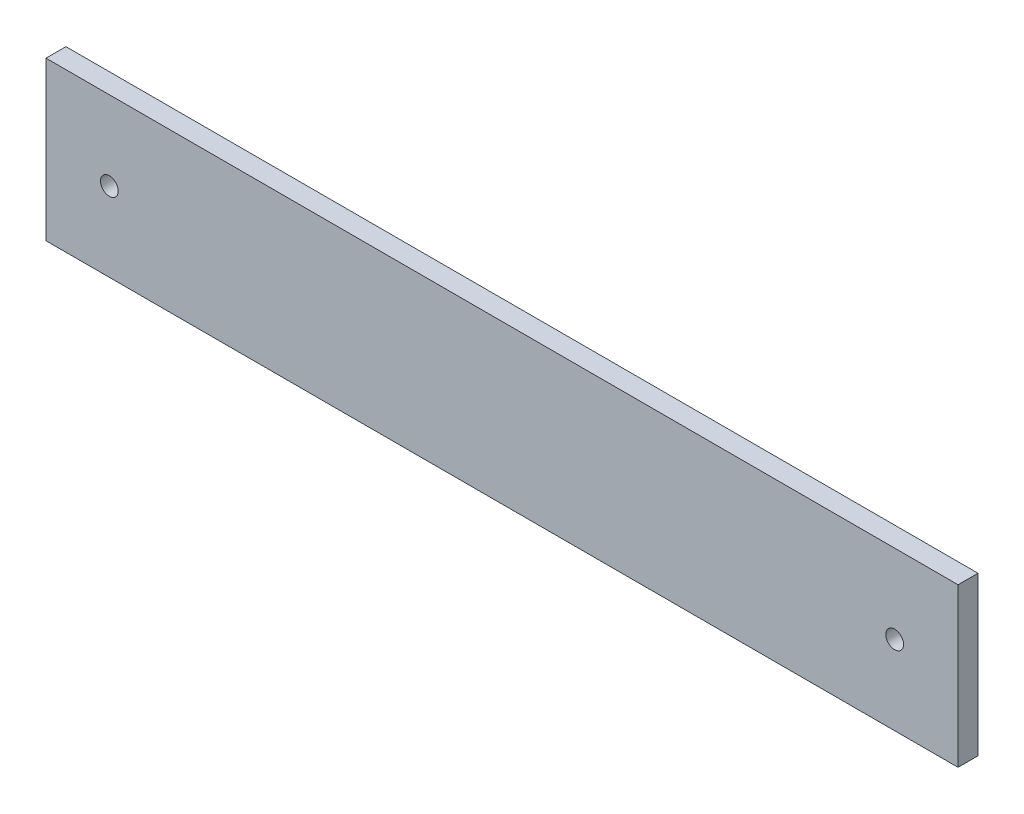
ISO-10303-21;
HEADER;
FILE_DESCRIPTION(('STEP AP214'),'2;1');
FILE_NAME('part.step','',(''),(''),'','','');
FILE_SCHEMA(('AUTOMOTIVE_DESIGN { 1 0 10303 214 1 1 1 1 }'));
ENDSEC;
DATA;
#1=APPLICATION_CONTEXT('core data for automotive mechanical design processes');
#2=APPLICATION_PROTOCOL_DEFINITION('international standard','automotive_design',2000,#1);
#3=PRODUCT_CONTEXT('',#1,'mechanical');
#4=PRODUCT('Part','Part','',(#3));
#5=PRODUCT_RELATED_PRODUCT_CATEGORY('part','',(#4));
#6=PRODUCT_DEFINITION_FORMATION('','',#4);
#7=PRODUCT_DEFINITION_CONTEXT('part definition',#1,'design');
#8=PRODUCT_DEFINITION('design','',#6,#7);
#9=PRODUCT_DEFINITION_SHAPE('','',#8);
#10=(LENGTH_UNIT() NAMED_UNIT(*) SI_UNIT(.MILLI.,.METRE.));
#11=(NAMED_UNIT(*) PLANE_ANGLE_UNIT() SI_UNIT($,.RADIAN.));
#12=(NAMED_UNIT(*) SI_UNIT($,.STERADIAN.) SOLID_ANGLE_UNIT());
#13=UNCERTAINTY_MEASURE_WITH_UNIT(LENGTH_MEASURE(1.E-05),#10,'distance_accuracy_value','');
#14=(GEOMETRIC_REPRESENTATION_CONTEXT(3) GLOBAL_UNCERTAINTY_ASSIGNED_CONTEXT((#13)) GLOBAL_UNIT_ASSIGNED_CONTEXT((#10,
#11,#12)) REPRESENTATION_CONTEXT('',''));
#15=CARTESIAN_POINT('',(0.,0.,0.));
#16=DIRECTION('',(0.,0.,1.));
#17=DIRECTION('',(1.,0.,0.));
#18=AXIS2_PLACEMENT_3D('',#15,#16,#17);
#19=CARTESIAN_POINT('',(0.,0.,3.175));
#20=DIRECTION('',(0.,0.,1.));
#21=DIRECTION('',(1.,0.,0.));
#22=AXIS2_PLACEMENT_3D('',#19,#20,#21);
#23=PLANE('',#22);
#24=CARTESIAN_POINT('',(-72.9352808051428,12.5,3.175));
#25=DIRECTION('',(0.,0.,1.));
#26=DIRECTION('',(1.,0.,0.));
#27=AXIS2_PLACEMENT_3D('',#24,#25,#26);
#28=CIRCLE('',#27,1.415);
#29=CARTESIAN_POINT('',(-71.5202808051427,12.5,3.175));
#30=VERTEX_POINT('',#29);
#31=EDGE_CURVE('E101',#30,#30,#28,.T.);
#32=ORIENTED_EDGE('',*,*,#31,.F.);
#33=EDGE_LOOP('',(#32));
#34=FACE_BOUND('',#33,.T.);
#35=DIRECTION('',(0.,-1.,0.));
#36=VECTOR('',#35,1.);
#37=CARTESIAN_POINT('',(-83.017378897971,25.0850222868298,3.175));
#38=LINE('',#37,#36);
#39=CARTESIAN_POINT('',(-83.017378897971,25.0850222868298,3.175));
#40=VERTEX_POINT('',#39);
#41=CARTESIAN_POINT('',(-83.017378897971,-0.0872443370543152,3.175));
#42=VERTEX_POINT('',#41);
#43=EDGE_CURVE('E86',#40,#42,#38,.T.);
#44=ORIENTED_EDGE('',*,*,#43,.T.);
#45=DIRECTION('',(1.,0.,0.));
#46=VECTOR('',#45,1.);
#47=CARTESIAN_POINT('',(-83.017378897971,-0.0872443370543152,3.175));
#48=LINE('',#47,#46);
#49=CARTESIAN_POINT('',(62.152621102029,-0.0872443370543152,3.175));
#50=VERTEX_POINT('',#49);
#51=EDGE_CURVE('E81',#42,#50,#48,.T.);
#52=ORIENTED_EDGE('',*,*,#51,.T.);
#53=DIRECTION('',(0.,1.,0.));
#54=VECTOR('',#53,1.);
#55=CARTESIAN_POINT('',(62.152621102029,25.0850222868298,3.175));
#56=LINE('',#55,#54);
#57=CARTESIAN_POINT('',(62.152621102029,25.0850222868298,3.175));
#58=VERTEX_POINT('',#57);
#59=EDGE_CURVE('E84',#50,#58,#56,.T.);
#60=ORIENTED_EDGE('',*,*,#59,.T.);
#61=DIRECTION('',(-1.,0.,0.));
#62=VECTOR('',#61,1.);
#63=CARTESIAN_POINT('',(-83.017378897971,25.0850222868298,3.175));
#64=LINE('',#63,#62);
#65=EDGE_CURVE('E51',#58,#40,#64,.T.);
#66=ORIENTED_EDGE('',*,*,#65,.T.);
#67=EDGE_LOOP('',(#44,#52,#60,#66));
#68=FACE_BOUND('',#67,.T.);
#69=CARTESIAN_POINT('',(52.0647191948572,12.5,3.175));
#70=DIRECTION('',(0.,0.,1.));
#71=DIRECTION('',(1.,0.,0.));
#72=AXIS2_PLACEMENT_3D('',#69,#70,#71);
#73=CIRCLE('',#72,1.415);
#74=CARTESIAN_POINT('',(53.4797191948572,12.5,3.175));
#75=VERTEX_POINT('',#74);
#76=EDGE_CURVE('E116',#75,#75,#73,.T.);
#77=ORIENTED_EDGE('',*,*,#76,.F.);
#78=EDGE_LOOP('',(#77));
#79=FACE_BOUND('',#78,.T.);
#80=ADVANCED_FACE('F34',(#34,#68,#79),#23,.T.);
#81=CARTESIAN_POINT('',(0.,0.,0.));
#82=DIRECTION('',(0.,0.,1.));
#83=DIRECTION('',(1.,0.,0.));
#84=AXIS2_PLACEMENT_3D('',#81,#82,#83);
#85=PLANE('',#84);
#86=DIRECTION('',(0.,-1.,0.));
#87=VECTOR('',#86,1.);
#88=CARTESIAN_POINT('',(-83.017378897971,25.0850222868298,0.));
#89=LINE('',#88,#87);
#90=CARTESIAN_POINT('',(-83.017378897971,25.0850222868298,0.));
#91=VERTEX_POINT('',#90);
#92=CARTESIAN_POINT('',(-83.017378897971,-0.0872443370543152,0.));
#93=VERTEX_POINT('',#92);
#94=EDGE_CURVE('E98',#91,#93,#89,.T.);
#95=ORIENTED_EDGE('',*,*,#94,.F.);
#96=DIRECTION('',(-1.,0.,0.));
#97=VECTOR('',#96,1.);
#98=CARTESIAN_POINT('',(-83.017378897971,25.0850222868298,0.));
#99=LINE('',#98,#97);
#100=CARTESIAN_POINT('',(62.152621102029,25.0850222868298,0.));
#101=VERTEX_POINT('',#100);
#102=EDGE_CURVE('E74',#101,#91,#99,.T.);
#103=ORIENTED_EDGE('',*,*,#102,.F.);
#104=DIRECTION('',(0.,1.,0.));
#105=VECTOR('',#104,1.);
#106=CARTESIAN_POINT('',(62.152621102029,25.0850222868298,0.));
#107=LINE('',#106,#105);
#108=CARTESIAN_POINT('',(62.152621102029,-0.0872443370543152,0.));
#109=VERTEX_POINT('',#108);
#110=EDGE_CURVE('E68',#109,#101,#107,.T.);
#111=ORIENTED_EDGE('',*,*,#110,.F.);
#112=DIRECTION('',(1.,0.,0.));
#113=VECTOR('',#112,1.);
#114=CARTESIAN_POINT('',(-83.017378897971,-0.0872443370543152,0.));
#115=LINE('',#114,#113);
#116=EDGE_CURVE('E90',#93,#109,#115,.T.);
#117=ORIENTED_EDGE('',*,*,#116,.F.);
#118=EDGE_LOOP('',(#95,#103,#111,#117));
#119=FACE_BOUND('',#118,.T.);
#120=CARTESIAN_POINT('',(-72.9352808051428,12.5,0.));
#121=DIRECTION('',(0.,0.,1.));
#122=DIRECTION('',(1.,0.,0.));
#123=AXIS2_PLACEMENT_3D('',#120,#121,#122);
#124=CIRCLE('',#123,1.415);
#125=CARTESIAN_POINT('',(-71.5202808051427,12.5,0.));
#126=VERTEX_POINT('',#125);
#127=EDGE_CURVE('E113',#126,#126,#124,.T.);
#128=ORIENTED_EDGE('',*,*,#127,.T.);
#129=EDGE_LOOP('',(#128));
#130=FACE_BOUND('',#129,.T.);
#131=CARTESIAN_POINT('',(52.0647191948572,12.5,0.));
#132=DIRECTION('',(0.,0.,1.));
#133=DIRECTION('',(1.,0.,0.));
#134=AXIS2_PLACEMENT_3D('',#131,#132,#133);
#135=CIRCLE('',#134,1.415);
#136=CARTESIAN_POINT('',(53.4797191948572,12.5,0.));
#137=VERTEX_POINT('',#136);
#138=EDGE_CURVE('E119',#137,#137,#135,.T.);
#139=ORIENTED_EDGE('',*,*,#138,.T.);
#140=EDGE_LOOP('',(#139));
#141=FACE_BOUND('',#140,.T.);
#142=ADVANCED_FACE('F109',(#119,#130,#141),#85,.F.);
#143=CARTESIAN_POINT('',(-83.017378897971,25.0850222868298,3.175));
#144=DIRECTION('',(1.,0.,0.));
#145=DIRECTION('',(0.,0.,-1.));
#146=AXIS2_PLACEMENT_3D('',#143,#144,#145);
#147=PLANE('',#146);
#148=ORIENTED_EDGE('',*,*,#94,.T.);
#149=DIRECTION('',(0.,0.,-1.));
#150=VECTOR('',#149,1.);
#151=CARTESIAN_POINT('',(-83.017378897971,-0.0872443370543152,3.175));
#152=LINE('',#151,#150);
#153=EDGE_CURVE('E11',#42,#93,#152,.T.);
#154=ORIENTED_EDGE('',*,*,#153,.F.);
#155=ORIENTED_EDGE('',*,*,#43,.F.);
#156=DIRECTION('',(0.,0.,-1.));
#157=VECTOR('',#156,1.);
#158=CARTESIAN_POINT('',(-83.017378897971,25.0850222868298,3.175));
#159=LINE('',#158,#157);
#160=EDGE_CURVE('E94',#40,#91,#159,.T.);
#161=ORIENTED_EDGE('',*,*,#160,.T.);
#162=EDGE_LOOP('',(#148,#154,#155,#161));
#163=FACE_BOUND('',#162,.T.);
#164=ADVANCED_FACE('F36',(#163),#147,.F.);
#165=CARTESIAN_POINT('',(-83.017378897971,-0.0872443370543152,3.175));
#166=DIRECTION('',(0.,1.,0.));
#167=DIRECTION('',(0.,0.,1.));
#168=AXIS2_PLACEMENT_3D('',#165,#166,#167);
#169=PLANE('',#168);
#170=ORIENTED_EDGE('',*,*,#116,.T.);
#171=DIRECTION('',(0.,0.,-1.));
#172=VECTOR('',#171,1.);
#173=CARTESIAN_POINT('',(62.152621102029,-0.0872443370543152,3.175));
#174=LINE('',#173,#172);
#175=EDGE_CURVE('E43',#50,#109,#174,.T.);
#176=ORIENTED_EDGE('',*,*,#175,.F.);
#177=ORIENTED_EDGE('',*,*,#51,.F.);
#178=ORIENTED_EDGE('',*,*,#153,.T.);
#179=EDGE_LOOP('',(#170,#176,#177,#178));
#180=FACE_BOUND('',#179,.T.);
#181=ADVANCED_FACE('F89',(#180),#169,.F.);
#182=CARTESIAN_POINT('',(62.152621102029,25.0850222868298,3.175));
#183=DIRECTION('',(-1.,0.,0.));
#184=DIRECTION('',(0.,0.,1.));
#185=AXIS2_PLACEMENT_3D('',#182,#183,#184);
#186=PLANE('',#185);
#187=ORIENTED_EDGE('',*,*,#110,.T.);
#188=DIRECTION('',(0.,0.,-1.));
#189=VECTOR('',#188,1.);
#190=CARTESIAN_POINT('',(62.152621102029,25.0850222868298,3.175));
#191=LINE('',#190,#189);
#192=EDGE_CURVE('E91',#58,#101,#191,.T.);
#193=ORIENTED_EDGE('',*,*,#192,.F.);
#194=ORIENTED_EDGE('',*,*,#59,.F.);
#195=ORIENTED_EDGE('',*,*,#175,.T.);
#196=EDGE_LOOP('',(#187,#193,#194,#195));
#197=FACE_BOUND('',#196,.T.);
#198=ADVANCED_FACE('F92',(#197),#186,.F.);
#199=CARTESIAN_POINT('',(-83.017378897971,25.0850222868298,3.175));
#200=DIRECTION('',(0.,-1.,0.));
#201=DIRECTION('',(0.,0.,-1.));
#202=AXIS2_PLACEMENT_3D('',#199,#200,#201);
#203=PLANE('',#202);
#204=ORIENTED_EDGE('',*,*,#102,.T.);
#205=ORIENTED_EDGE('',*,*,#160,.F.);
#206=ORIENTED_EDGE('',*,*,#65,.F.);
#207=ORIENTED_EDGE('',*,*,#192,.T.);
#208=EDGE_LOOP('',(#204,#205,#206,#207));
#209=FACE_BOUND('',#208,.T.);
#210=ADVANCED_FACE('F106',(#209),#203,.F.);
#211=CARTESIAN_POINT('',(-72.9352808051428,12.5,3.175));
#212=DIRECTION('',(0.,0.,-1.));
#213=DIRECTION('',(-1.,0.,0.));
#214=AXIS2_PLACEMENT_3D('',#211,#212,#213);
#215=CYLINDRICAL_SURFACE('',#214,1.415);
#216=ORIENTED_EDGE('',*,*,#31,.T.);
#217=EDGE_LOOP('',(#216));
#218=FACE_BOUND('',#217,.T.);
#219=ORIENTED_EDGE('',*,*,#127,.F.);
#220=EDGE_LOOP('',(#219));
#221=FACE_BOUND('',#220,.T.);
#222=ADVANCED_FACE('F136',(#218,#221),#215,.F.);
#223=CARTESIAN_POINT('',(52.0647191948572,12.5,3.175));
#224=DIRECTION('',(0.,0.,-1.));
#225=DIRECTION('',(-1.,0.,0.));
#226=AXIS2_PLACEMENT_3D('',#223,#224,#225);
#227=CYLINDRICAL_SURFACE('',#226,1.415);
#228=ORIENTED_EDGE('',*,*,#76,.T.);
#229=EDGE_LOOP('',(#228));
#230=FACE_BOUND('',#229,.T.);
#231=ORIENTED_EDGE('',*,*,#138,.F.);
#232=EDGE_LOOP('',(#231));
#233=FACE_BOUND('',#232,.T.);
#234=ADVANCED_FACE('F125',(#230,#233),#227,.F.);
#235=CLOSED_SHELL('',(#80,#142,#164,#181,#198,#210,#222,#234));
#236=MANIFOLD_SOLID_BREP('B2',#235);
#237=ADVANCED_BREP_SHAPE_REPRESENTATION('',(#18,#236),#14);
#238=SHAPE_DEFINITION_REPRESENTATION(#9,#237);
ENDSEC;
END-ISO-10303-21;
